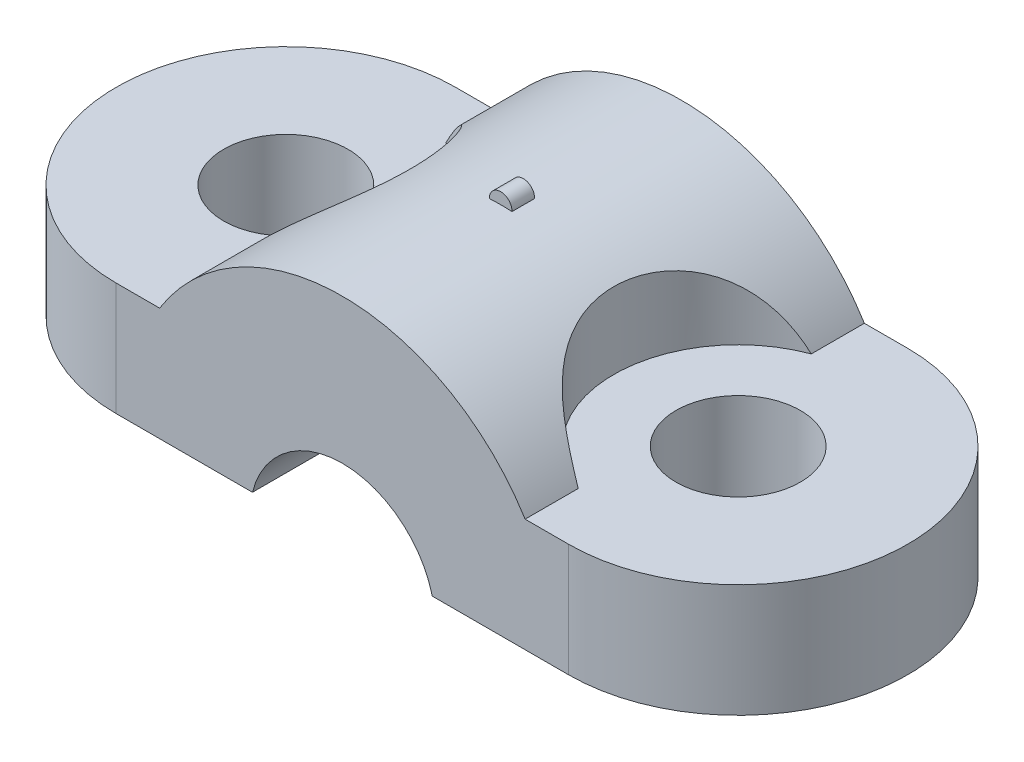
ISO-10303-21;
HEADER;
FILE_DESCRIPTION(('STEP AP214'),'2;1');
FILE_NAME('part.step','',(''),(''),'','','');
FILE_SCHEMA(('AUTOMOTIVE_DESIGN { 1 0 10303 214 1 1 1 1 }'));
ENDSEC;
DATA;
#1=APPLICATION_CONTEXT('core data for automotive mechanical design processes');
#2=APPLICATION_PROTOCOL_DEFINITION('international standard','automotive_design',2000,#1);
#3=PRODUCT_CONTEXT('',#1,'mechanical');
#4=PRODUCT('Part','Part','',(#3));
#5=PRODUCT_RELATED_PRODUCT_CATEGORY('part','',(#4));
#6=PRODUCT_DEFINITION_FORMATION('','',#4);
#7=PRODUCT_DEFINITION_CONTEXT('part definition',#1,'design');
#8=PRODUCT_DEFINITION('design','',#6,#7);
#9=PRODUCT_DEFINITION_SHAPE('','',#8);
#10=(LENGTH_UNIT() NAMED_UNIT(*) SI_UNIT(.MILLI.,.METRE.));
#11=(NAMED_UNIT(*) PLANE_ANGLE_UNIT() SI_UNIT($,.RADIAN.));
#12=(NAMED_UNIT(*) SI_UNIT($,.STERADIAN.) SOLID_ANGLE_UNIT());
#13=UNCERTAINTY_MEASURE_WITH_UNIT(LENGTH_MEASURE(1.E-05),#10,'distance_accuracy_value','');
#14=(GEOMETRIC_REPRESENTATION_CONTEXT(3) GLOBAL_UNCERTAINTY_ASSIGNED_CONTEXT((#13)) GLOBAL_UNIT_ASSIGNED_CONTEXT((#10,
#11,#12)) REPRESENTATION_CONTEXT('',''));
#15=CARTESIAN_POINT('',(0.,0.,0.));
#16=DIRECTION('',(0.,0.,1.));
#17=DIRECTION('',(1.,0.,0.));
#18=AXIS2_PLACEMENT_3D('',#15,#16,#17);
#19=CARTESIAN_POINT('',(0.,0.,0.));
#20=DIRECTION('',(0.,1.,0.));
#21=DIRECTION('',(0.,0.,1.));
#22=AXIS2_PLACEMENT_3D('',#19,#20,#21);
#23=PLANE('',#22);
#24=CARTESIAN_POINT('',(-10.,0.,0.));
#25=DIRECTION('',(0.,1.,0.));
#26=DIRECTION('',(0.,0.,1.));
#27=AXIS2_PLACEMENT_3D('',#24,#25,#26);
#28=CIRCLE('',#27,2.75);
#29=CARTESIAN_POINT('',(-10.,0.,2.75));
#30=VERTEX_POINT('',#29);
#31=EDGE_CURVE('E215',#30,#30,#28,.T.);
#32=ORIENTED_EDGE('',*,*,#31,.T.);
#33=EDGE_LOOP('',(#32));
#34=FACE_BOUND('',#33,.T.);
#35=DIRECTION('',(1.,0.,0.));
#36=VECTOR('',#35,1.);
#37=CARTESIAN_POINT('',(0.,0.,-7.5));
#38=LINE('',#37,#36);
#39=CARTESIAN_POINT('',(-10.,0.,-7.5));
#40=VERTEX_POINT('',#39);
#41=CARTESIAN_POINT('',(-3.97617907041421,0.,-7.5));
#42=VERTEX_POINT('',#41);
#43=EDGE_CURVE('E198',#40,#42,#38,.T.);
#44=ORIENTED_EDGE('',*,*,#43,.T.);
#45=DIRECTION('',(0.,0.,1.));
#46=VECTOR('',#45,1.);
#47=CARTESIAN_POINT('',(-3.97617907041421,0.,-7.5));
#48=LINE('',#47,#46);
#49=CARTESIAN_POINT('',(-3.97617907041421,0.,7.5));
#50=VERTEX_POINT('',#49);
#51=EDGE_CURVE('E147',#42,#50,#48,.T.);
#52=ORIENTED_EDGE('',*,*,#51,.T.);
#53=DIRECTION('',(1.,0.,0.));
#54=VECTOR('',#53,1.);
#55=CARTESIAN_POINT('',(0.,0.,7.5));
#56=LINE('',#55,#54);
#57=CARTESIAN_POINT('',(-10.,0.,7.5));
#58=VERTEX_POINT('',#57);
#59=EDGE_CURVE('E11',#58,#50,#56,.T.);
#60=ORIENTED_EDGE('',*,*,#59,.F.);
#61=CARTESIAN_POINT('',(-10.,0.,0.));
#62=DIRECTION('',(0.,1.,0.));
#63=DIRECTION('',(0.,0.,1.));
#64=AXIS2_PLACEMENT_3D('',#61,#62,#63);
#65=CIRCLE('',#64,7.5);
#66=EDGE_CURVE('E207',#40,#58,#65,.T.);
#67=ORIENTED_EDGE('',*,*,#66,.F.);
#68=EDGE_LOOP('',(#44,#52,#60,#67));
#69=FACE_BOUND('',#68,.T.);
#70=ADVANCED_FACE('F34',(#34,#69),#23,.F.);
#71=CARTESIAN_POINT('',(0.,9.5,-7.5));
#72=DIRECTION('',(0.,0.,-1.));
#73=DIRECTION('',(-1.,0.,0.));
#74=AXIS2_PLACEMENT_3D('',#71,#72,#73);
#75=PLANE('',#74);
#76=CARTESIAN_POINT('',(0.,-0.999999999999999,-7.5));
#77=DIRECTION('',(0.,0.,1.));
#78=DIRECTION('',(1.,0.,0.));
#79=AXIS2_PLACEMENT_3D('',#76,#77,#78);
#80=CIRCLE('',#79,4.1);
#81=CARTESIAN_POINT('',(3.97617907041421,0.,-7.5));
#82=VERTEX_POINT('',#81);
#83=EDGE_CURVE('E142',#82,#42,#80,.T.);
#84=ORIENTED_EDGE('',*,*,#83,.T.);
#85=ORIENTED_EDGE('',*,*,#43,.F.);
#86=DIRECTION('',(0.,-1.,0.));
#87=VECTOR('',#86,1.);
#88=CARTESIAN_POINT('',(-10.,5.,-7.5));
#89=LINE('',#88,#87);
#90=CARTESIAN_POINT('',(-10.,5.,-7.5));
#91=VERTEX_POINT('',#90);
#92=EDGE_CURVE('E208',#91,#40,#89,.T.);
#93=ORIENTED_EDGE('',*,*,#92,.F.);
#94=DIRECTION('',(1.,0.,0.));
#95=VECTOR('',#94,1.);
#96=CARTESIAN_POINT('',(0.,5.,-7.5));
#97=LINE('',#96,#95);
#98=CARTESIAN_POINT('',(-8.08,5.,-7.5));
#99=VERTEX_POINT('',#98);
#100=EDGE_CURVE('E228',#91,#99,#97,.T.);
#101=ORIENTED_EDGE('',*,*,#100,.T.);
#102=CARTESIAN_POINT('',(0.,-0.00404444444444992,-7.5));
#103=DIRECTION('',(0.,0.,1.));
#104=DIRECTION('',(1.,0.,0.));
#105=AXIS2_PLACEMENT_3D('',#102,#103,#104);
#106=CIRCLE('',#105,9.50404444444445);
#107=CARTESIAN_POINT('',(8.08,5.,-7.5));
#108=VERTEX_POINT('',#107);
#109=EDGE_CURVE('E158',#99,#108,#106,.F.);
#110=ORIENTED_EDGE('',*,*,#109,.T.);
#111=DIRECTION('',(1.,0.,0.));
#112=VECTOR('',#111,1.);
#113=CARTESIAN_POINT('',(0.,5.,-7.5));
#114=LINE('',#113,#112);
#115=CARTESIAN_POINT('',(10.,5.,-7.5));
#116=VERTEX_POINT('',#115);
#117=EDGE_CURVE('E249',#108,#116,#114,.T.);
#118=ORIENTED_EDGE('',*,*,#117,.T.);
#119=DIRECTION('',(0.,-1.,0.));
#120=VECTOR('',#119,1.);
#121=CARTESIAN_POINT('',(10.,5.,-7.5));
#122=LINE('',#121,#120);
#123=CARTESIAN_POINT('',(10.,0.,-7.5));
#124=VERTEX_POINT('',#123);
#125=EDGE_CURVE('E239',#116,#124,#122,.T.);
#126=ORIENTED_EDGE('',*,*,#125,.T.);
#127=EDGE_CURVE('E201',#82,#124,#38,.T.);
#128=ORIENTED_EDGE('',*,*,#127,.F.);
#129=EDGE_LOOP('',(#84,#85,#93,#101,#110,#118,#126,#128));
#130=FACE_BOUND('',#129,.T.);
#131=ADVANCED_FACE('F187',(#130),#75,.T.);
#132=CARTESIAN_POINT('',(0.,9.5,7.5));
#133=DIRECTION('',(0.,0.,-1.));
#134=DIRECTION('',(-1.,0.,0.));
#135=AXIS2_PLACEMENT_3D('',#132,#133,#134);
#136=PLANE('',#135);
#137=ORIENTED_EDGE('',*,*,#59,.T.);
#138=CARTESIAN_POINT('',(0.,-0.999999999999999,7.5));
#139=DIRECTION('',(0.,0.,1.));
#140=DIRECTION('',(1.,0.,0.));
#141=AXIS2_PLACEMENT_3D('',#138,#139,#140);
#142=CIRCLE('',#141,4.1);
#143=CARTESIAN_POINT('',(3.97617907041421,0.,7.5));
#144=VERTEX_POINT('',#143);
#145=EDGE_CURVE('E141',#144,#50,#142,.T.);
#146=ORIENTED_EDGE('',*,*,#145,.F.);
#147=CARTESIAN_POINT('',(10.,0.,7.5));
#148=VERTEX_POINT('',#147);
#149=EDGE_CURVE('E43',#144,#148,#56,.T.);
#150=ORIENTED_EDGE('',*,*,#149,.T.);
#151=DIRECTION('',(0.,-1.,0.));
#152=VECTOR('',#151,1.);
#153=CARTESIAN_POINT('',(10.,5.,7.5));
#154=LINE('',#153,#152);
#155=CARTESIAN_POINT('',(10.,5.,7.5));
#156=VERTEX_POINT('',#155);
#157=EDGE_CURVE('E220',#156,#148,#154,.T.);
#158=ORIENTED_EDGE('',*,*,#157,.F.);
#159=DIRECTION('',(1.,0.,0.));
#160=VECTOR('',#159,1.);
#161=CARTESIAN_POINT('',(0.,5.,7.5));
#162=LINE('',#161,#160);
#163=CARTESIAN_POINT('',(8.08,5.,7.5));
#164=VERTEX_POINT('',#163);
#165=EDGE_CURVE('E254',#164,#156,#162,.T.);
#166=ORIENTED_EDGE('',*,*,#165,.F.);
#167=CARTESIAN_POINT('',(0.,-0.00404444444444992,7.5));
#168=DIRECTION('',(0.,0.,1.));
#169=DIRECTION('',(1.,0.,0.));
#170=AXIS2_PLACEMENT_3D('',#167,#168,#169);
#171=CIRCLE('',#170,9.50404444444445);
#172=CARTESIAN_POINT('',(-8.08,5.,7.5));
#173=VERTEX_POINT('',#172);
#174=EDGE_CURVE('E157',#173,#164,#171,.F.);
#175=ORIENTED_EDGE('',*,*,#174,.F.);
#176=DIRECTION('',(1.,0.,0.));
#177=VECTOR('',#176,1.);
#178=CARTESIAN_POINT('',(0.,5.,7.5));
#179=LINE('',#178,#177);
#180=CARTESIAN_POINT('',(-10.,5.,7.5));
#181=VERTEX_POINT('',#180);
#182=EDGE_CURVE('E223',#181,#173,#179,.T.);
#183=ORIENTED_EDGE('',*,*,#182,.F.);
#184=DIRECTION('',(0.,-1.,0.));
#185=VECTOR('',#184,1.);
#186=CARTESIAN_POINT('',(-10.,5.,7.5));
#187=LINE('',#186,#185);
#188=EDGE_CURVE('E211',#181,#58,#187,.T.);
#189=ORIENTED_EDGE('',*,*,#188,.T.);
#190=EDGE_LOOP('',(#137,#146,#150,#158,#166,#175,#183,#189));
#191=FACE_BOUND('',#190,.T.);
#192=ADVANCED_FACE('F185',(#191),#136,.F.);
#193=CARTESIAN_POINT('',(10.,9.5,0.));
#194=DIRECTION('',(0.,-1.,0.));
#195=DIRECTION('',(0.,0.,-1.));
#196=AXIS2_PLACEMENT_3D('',#193,#194,#195);
#197=CYLINDRICAL_SURFACE('',#196,5.5);
#198=CARTESIAN_POINT('',(8.08,5.,5.1539887465923));
#199=CARTESIAN_POINT('',(7.99001563173181,5.14537029095498,5.12045202710558));
#200=CARTESIAN_POINT('',(7.89642080027451,5.2876648416954,5.08291490139109));
#201=CARTESIAN_POINT('',(7.70303619143883,5.56538729143438,4.99851462898592));
#202=CARTESIAN_POINT('',(7.60323825023025,5.70080569622129,4.95163900523841));
#203=CARTESIAN_POINT('',(7.39822899975281,5.96429797844464,4.84706858689315));
#204=CARTESIAN_POINT('',(7.29299392446025,6.09233332444659,4.78932275124168));
#205=CARTESIAN_POINT('',(7.07919423812253,6.33933866324696,4.66201228546329));
#206=CARTESIAN_POINT('',(6.97063158823109,6.4583138569845,4.59245451114239));
#207=CARTESIAN_POINT('',(6.77002561898331,6.66761599596033,4.45304749354069));
#208=CARTESIAN_POINT('',(6.67820013118659,6.75943742939677,4.38512546358434));
#209=CARTESIAN_POINT('',(6.49483287498101,6.93570850535153,4.23998448771444));
#210=CARTESIAN_POINT('',(6.4032910581131,7.02015948250038,4.16276723101617));
#211=CARTESIAN_POINT('',(6.22213791783691,7.18111426267204,3.99907706653871));
#212=CARTESIAN_POINT('',(6.13252200680799,7.25763913011599,3.91262999964637));
#213=CARTESIAN_POINT('',(5.95643697117863,7.40275908901513,3.7303687540728));
#214=CARTESIAN_POINT('',(5.86996780136252,7.47135429444287,3.63455471005909));
#215=CARTESIAN_POINT('',(5.70124719644635,7.60082296141688,3.43337170240056));
#216=CARTESIAN_POINT('',(5.61901839949237,7.66165711328524,3.32795839865091));
#217=CARTESIAN_POINT('',(5.46068184982798,7.77524301032143,3.10851985876541));
#218=CARTESIAN_POINT('',(5.38457425746823,7.8279945437903,2.99449439717768));
#219=CARTESIAN_POINT('',(5.23974783889334,7.92561771971182,2.75847560664738));
#220=CARTESIAN_POINT('',(5.17103605829657,7.97048187357141,2.63647485476747));
#221=CARTESIAN_POINT('',(5.04226321935938,8.05252280833811,2.3855256402096));
#222=CARTESIAN_POINT('',(4.98220169755516,8.08970000114394,2.25657755026534));
#223=CARTESIAN_POINT('',(4.87569571840315,8.15426707913313,2.00227913158619));
#224=CARTESIAN_POINT('',(4.82858229536027,8.18216883107698,1.87733791764317));
#225=CARTESIAN_POINT('',(4.7432772156176,8.23189039517921,1.62321717296968));
#226=CARTESIAN_POINT('',(4.70508867416853,8.25370808419313,1.49403618022434));
#227=CARTESIAN_POINT('',(4.63817572488957,8.29147622530342,1.23249757882539));
#228=CARTESIAN_POINT('',(4.60944532943068,8.30743039014418,1.10014203703577));
#229=CARTESIAN_POINT('',(4.56176669780388,8.33369431090743,0.833080930764921));
#230=CARTESIAN_POINT('',(4.5428218951031,8.34400208575988,0.698374558563418));
#231=CARTESIAN_POINT('',(4.51503828462937,8.35906135478321,0.428380394727918));
#232=CARTESIAN_POINT('',(4.50614357629464,8.36384358648628,0.293100062555013));
#233=CARTESIAN_POINT('',(4.49837528890235,8.36802222045578,0.0221690513639427));
#234=CARTESIAN_POINT('',(4.49950170082585,8.36741862756942,-0.113481627320805));
#235=CARTESIAN_POINT('',(4.51176368608058,8.36081643472608,-0.38422471554139));
#236=CARTESIAN_POINT('',(4.52290120430723,8.35481678645693,-0.519317011474745));
#237=CARTESIAN_POINT('',(4.55505038849556,8.33734097223021,-0.787916170946606));
#238=CARTESIAN_POINT('',(4.57605862016963,8.32586671101677,-0.921423569362649));
#239=CARTESIAN_POINT('',(4.62781292988375,8.29722570836424,-1.1865638287248));
#240=CARTESIAN_POINT('',(4.6586034271825,8.28003298351272,-1.31818521911614));
#241=CARTESIAN_POINT('',(4.72949049511725,8.23976776054407,-1.57792413672532));
#242=CARTESIAN_POINT('',(4.7695835890645,8.21669745875729,-1.70604295302427));
#243=CARTESIAN_POINT('',(4.85856357954256,8.16442428944372,-1.95792604850737));
#244=CARTESIAN_POINT('',(4.90745190221837,8.13522042723227,-2.0816896175919));
#245=CARTESIAN_POINT('',(5.01334827876581,8.07042458381926,-2.32395800884918));
#246=CARTESIAN_POINT('',(5.07035625249683,8.03483266566663,-2.44246288290989));
#247=CARTESIAN_POINT('',(5.19132819405616,7.95724331145843,-2.67273122361642));
#248=CARTESIAN_POINT('',(5.25525007007142,7.91528407191326,-2.7845296835744));
#249=CARTESIAN_POINT('',(5.38938362745487,7.82461791597135,-3.00141201562999));
#250=CARTESIAN_POINT('',(5.45959524542943,7.77591106758035,-3.10649595538424));
#251=CARTESIAN_POINT('',(5.6051944297775,7.67167449225916,-3.30926716864003));
#252=CARTESIAN_POINT('',(5.68057711881361,7.61615115661414,-3.40696123419716));
#253=CARTESIAN_POINT('',(5.83547574864086,7.49819261477784,-3.59465579730305));
#254=CARTESIAN_POINT('',(5.91499314997896,7.43575495724966,-3.68465354610437));
#255=CARTESIAN_POINT('',(6.07793913790115,7.30325823694817,-3.85768486544204));
#256=CARTESIAN_POINT('',(6.16140331673655,7.23311637598895,-3.94062141037416));
#257=CARTESIAN_POINT('',(6.33012485404885,7.086012440228,-4.09821250960134));
#258=CARTESIAN_POINT('',(6.41538237096791,7.00904976085756,-4.17286632842706));
#259=CARTESIAN_POINT('',(6.58670164493307,6.84840333431155,-4.31413384543037));
#260=CARTESIAN_POINT('',(6.67276477776184,6.76470488678345,-4.38072911800364));
#261=CARTESIAN_POINT('',(6.84439122105345,6.59111047836797,-4.50593131531683));
#262=CARTESIAN_POINT('',(6.92995461226864,6.50121555060063,-4.56453956688047));
#263=CARTESIAN_POINT('',(7.11039937051045,6.30381993408541,-4.68115048657111));
#264=CARTESIAN_POINT('',(7.20508286045697,6.1955337381665,-4.73812944608902));
#265=CARTESIAN_POINT('',(7.39139372656363,5.97218594834049,-4.84320317212035));
#266=CARTESIAN_POINT('',(7.48302002866022,5.85712201170591,-4.8912948426942));
#267=CARTESIAN_POINT('',(7.66177586574647,5.62141615772103,-4.97921645036869));
#268=CARTESIAN_POINT('',(7.74892334902326,5.50080089762206,-5.01908167299271));
#269=CARTESIAN_POINT('',(7.91830939750818,5.2542538569602,-5.0916615235222));
#270=CARTESIAN_POINT('',(8.00055221110987,5.12832684372751,-5.12438240717257));
#271=CARTESIAN_POINT('',(8.08,5.,-5.15398874659229));
#272=B_SPLINE_CURVE_WITH_KNOTS('',3,(#198,#199,#200,#201,#202,#203,#204,#205,#206,#207,#208,
#209,#210,#211,#212,#213,#214,#215,#216,#217,#218,#219,#220,#221,#222,#223,#224,#225,#226,#227,
#228,#229,#230,#231,#232,#233,#234,#235,#236,#237,#238,#239,#240,#241,#242,#243,#244,#245,#246,
#247,#248,#249,#250,#251,#252,#253,#254,#255,#256,#257,#258,#259,#260,#261,#262,#263,#264,#265,
#266,#267,#268,#269,#270,#271),.UNSPECIFIED.,.F.,.F.,(4,2,2,2,2,2,2,2,2,2,2,2,2,2,2,2,2,2,2,2,2,
2,2,2,2,2,2,2,2,2,2,2,2,2,2,2,4),(0.,0.522671156148208,1.04604538796136,1.57194135890126,
2.09753312963723,2.5367327541687,2.97585268340231,3.41377393017173,3.85168888194289,
4.29174054629022,4.73180373444884,5.17228250589281,5.61273766856725,6.02148927877775,
6.430383352304,6.83901806893623,7.24779606584504,7.65428899213027,8.06078155257461,
8.46735310093515,8.87378329671269,9.28208603941171,9.69023643093759,10.0984530637356,
10.5066656677327,10.9125197880747,11.3183698183164,11.7238421801669,12.1294587572976,
12.5399647620607,12.9505071888116,13.3619712478386,13.7733668698959,14.237049740574,
14.7008938346784,15.1627050054456,15.624110167645),.UNSPECIFIED.);
#273=CARTESIAN_POINT('',(8.08,5.,5.15398874659229));
#274=VERTEX_POINT('',#273);
#275=CARTESIAN_POINT('',(8.08,5.,-5.15398874659229));
#276=VERTEX_POINT('',#275);
#277=EDGE_CURVE('E150',#274,#276,#272,.T.);
#278=ORIENTED_EDGE('',*,*,#277,.F.);
#279=CARTESIAN_POINT('',(10.,5.,0.));
#280=DIRECTION('',(0.,1.,0.));
#281=DIRECTION('',(0.,0.,1.));
#282=AXIS2_PLACEMENT_3D('',#279,#280,#281);
#283=CIRCLE('',#282,5.5);
#284=EDGE_CURVE('E257',#276,#274,#283,.T.);
#285=ORIENTED_EDGE('',*,*,#284,.F.);
#286=EDGE_LOOP('',(#278,#285));
#287=FACE_BOUND('',#286,.T.);
#288=ADVANCED_FACE('F36',(#287),#197,.F.);
#289=CARTESIAN_POINT('',(-10.,9.5,0.));
#290=DIRECTION('',(0.,-1.,0.));
#291=DIRECTION('',(0.,0.,-1.));
#292=AXIS2_PLACEMENT_3D('',#289,#290,#291);
#293=CYLINDRICAL_SURFACE('',#292,5.5);
#294=CARTESIAN_POINT('',(-8.08,5.,-5.15398874659229));
#295=CARTESIAN_POINT('',(-7.99001563173182,5.14537029095499,-5.12045202710558));
#296=CARTESIAN_POINT('',(-7.89642080027452,5.28766484169541,-5.08291490139109));
#297=CARTESIAN_POINT('',(-7.70303619143883,5.56538729143438,-4.99851462898592));
#298=CARTESIAN_POINT('',(-7.60323825023026,5.7008056962213,-4.95163900523841));
#299=CARTESIAN_POINT('',(-7.39822899975281,5.96429797844465,-4.84706858689314));
#300=CARTESIAN_POINT('',(-7.29299392446025,6.09233332444659,-4.78932275124168));
#301=CARTESIAN_POINT('',(-7.07919423812253,6.33933866324696,-4.66201228546328));
#302=CARTESIAN_POINT('',(-6.9706315882311,6.45831385698451,-4.59245451114239));
#303=CARTESIAN_POINT('',(-6.77002561898331,6.66761599596033,-4.45304749354069));
#304=CARTESIAN_POINT('',(-6.67820013118659,6.75943742939678,-4.38512546358434));
#305=CARTESIAN_POINT('',(-6.49483287498101,6.93570850535153,-4.23998448771444));
#306=CARTESIAN_POINT('',(-6.4032910581131,7.02015948250038,-4.16276723101617));
#307=CARTESIAN_POINT('',(-6.22213791783691,7.18111426267204,-3.9990770665387));
#308=CARTESIAN_POINT('',(-6.13252200680799,7.25763913011599,-3.91262999964637));
#309=CARTESIAN_POINT('',(-5.95643697117864,7.40275908901513,-3.7303687540728));
#310=CARTESIAN_POINT('',(-5.86996780136253,7.47135429444287,-3.63455471005909));
#311=CARTESIAN_POINT('',(-5.70124719644635,7.60082296141688,-3.43337170240056));
#312=CARTESIAN_POINT('',(-5.61901839949237,7.66165711328524,-3.32795839865091));
#313=CARTESIAN_POINT('',(-5.46068184982799,7.77524301032144,-3.10851985876541));
#314=CARTESIAN_POINT('',(-5.38457425746824,7.8279945437903,-2.99449439717768));
#315=CARTESIAN_POINT('',(-5.23974783889334,7.92561771971182,-2.75847560664738));
#316=CARTESIAN_POINT('',(-5.17103605829658,7.97048187357141,-2.63647485476747));
#317=CARTESIAN_POINT('',(-5.04226321935938,8.05252280833811,-2.3855256402096));
#318=CARTESIAN_POINT('',(-4.98220169755516,8.08970000114394,-2.25657755026534));
#319=CARTESIAN_POINT('',(-4.87569571840315,8.15426707913313,-2.0022791315862));
#320=CARTESIAN_POINT('',(-4.82858229536027,8.18216883107698,-1.87733791764317));
#321=CARTESIAN_POINT('',(-4.74327721561761,8.23189039517922,-1.62321717296969));
#322=CARTESIAN_POINT('',(-4.70508867416853,8.25370808419313,-1.49403618022434));
#323=CARTESIAN_POINT('',(-4.63817572488957,8.29147622530342,-1.2324975788254));
#324=CARTESIAN_POINT('',(-4.60944532943068,8.30743039014418,-1.10014203703578));
#325=CARTESIAN_POINT('',(-4.56176669780389,8.33369431090743,-0.833080930764929));
#326=CARTESIAN_POINT('',(-4.5428218951031,8.34400208575988,-0.698374558563427));
#327=CARTESIAN_POINT('',(-4.51503828462937,8.35906135478321,-0.428380394727927));
#328=CARTESIAN_POINT('',(-4.50614357629464,8.36384358648628,-0.293100062555022));
#329=CARTESIAN_POINT('',(-4.49837528890235,8.36802222045578,-0.0221690513639521));
#330=CARTESIAN_POINT('',(-4.49950170082585,8.36741862756942,0.113481627320795));
#331=CARTESIAN_POINT('',(-4.51176368608058,8.36081643472609,0.384224715541381));
#332=CARTESIAN_POINT('',(-4.52290120430723,8.35481678645693,0.519317011474737));
#333=CARTESIAN_POINT('',(-4.55505038849556,8.33734097223022,0.787916170946599));
#334=CARTESIAN_POINT('',(-4.57605862016964,8.32586671101678,0.921423569362642));
#335=CARTESIAN_POINT('',(-4.62781292988375,8.29722570836424,1.18656382872479));
#336=CARTESIAN_POINT('',(-4.6586034271825,8.28003298351273,1.31818521911613));
#337=CARTESIAN_POINT('',(-4.72949049511725,8.23976776054407,1.57792413672531));
#338=CARTESIAN_POINT('',(-4.7695835890645,8.21669745875729,1.70604295302426));
#339=CARTESIAN_POINT('',(-4.85856357954256,8.16442428944372,1.95792604850737));
#340=CARTESIAN_POINT('',(-4.90745190221837,8.13522042723227,2.08168961759189));
#341=CARTESIAN_POINT('',(-5.01334827876581,8.07042458381927,2.32395800884917));
#342=CARTESIAN_POINT('',(-5.07035625249683,8.03483266566664,2.44246288290988));
#343=CARTESIAN_POINT('',(-5.19132819405616,7.95724331145843,2.67273122361641));
#344=CARTESIAN_POINT('',(-5.25525007007141,7.91528407191326,2.7845296835744));
#345=CARTESIAN_POINT('',(-5.38938362745487,7.82461791597136,3.00141201562998));
#346=CARTESIAN_POINT('',(-5.45959524542943,7.77591106758036,3.10649595538423));
#347=CARTESIAN_POINT('',(-5.6051944297775,7.67167449225917,3.30926716864003));
#348=CARTESIAN_POINT('',(-5.68057711881361,7.61615115661414,3.40696123419715));
#349=CARTESIAN_POINT('',(-5.83547574864086,7.49819261477785,3.59465579730305));
#350=CARTESIAN_POINT('',(-5.91499314997896,7.43575495724967,3.68465354610436));
#351=CARTESIAN_POINT('',(-6.07793913790115,7.30325823694818,3.85768486544203));
#352=CARTESIAN_POINT('',(-6.16140331673655,7.23311637598896,3.94062141037416));
#353=CARTESIAN_POINT('',(-6.33012485404885,7.086012440228,4.09821250960133));
#354=CARTESIAN_POINT('',(-6.4153823709679,7.00904976085757,4.17286632842706));
#355=CARTESIAN_POINT('',(-6.58670164493307,6.84840333431156,4.31413384543037));
#356=CARTESIAN_POINT('',(-6.67276477776184,6.76470488678345,4.38072911800364));
#357=CARTESIAN_POINT('',(-6.84439122105345,6.59111047836798,4.50593131531683));
#358=CARTESIAN_POINT('',(-6.92995461226863,6.50121555060064,4.56453956688047));
#359=CARTESIAN_POINT('',(-7.11039937051045,6.30381993408542,4.68115048657111));
#360=CARTESIAN_POINT('',(-7.20508286045697,6.19553373816651,4.73812944608902));
#361=CARTESIAN_POINT('',(-7.39139372656363,5.9721859483405,4.84320317212035));
#362=CARTESIAN_POINT('',(-7.48302002866022,5.85712201170592,4.8912948426942));
#363=CARTESIAN_POINT('',(-7.66177586574647,5.62141615772104,4.97921645036869));
#364=CARTESIAN_POINT('',(-7.74892334902326,5.50080089762206,5.01908167299271));
#365=CARTESIAN_POINT('',(-7.91830939750818,5.25425385696021,5.0916615235222));
#366=CARTESIAN_POINT('',(-8.00055221110987,5.12832684372751,5.12438240717257));
#367=CARTESIAN_POINT('',(-8.08,5.,5.15398874659229));
#368=B_SPLINE_CURVE_WITH_KNOTS('',3,(#294,#295,#296,#297,#298,#299,#300,#301,#302,#303,#304,
#305,#306,#307,#308,#309,#310,#311,#312,#313,#314,#315,#316,#317,#318,#319,#320,#321,#322,#323,
#324,#325,#326,#327,#328,#329,#330,#331,#332,#333,#334,#335,#336,#337,#338,#339,#340,#341,#342,
#343,#344,#345,#346,#347,#348,#349,#350,#351,#352,#353,#354,#355,#356,#357,#358,#359,#360,#361,
#362,#363,#364,#365,#366,#367),.UNSPECIFIED.,.F.,.F.,(4,2,2,2,2,2,2,2,2,2,2,2,2,2,2,2,2,2,2,2,2,
2,2,2,2,2,2,2,2,2,2,2,2,2,2,2,4),(0.,0.522671156148207,1.04604538796136,1.57194135890126,
2.09753312963723,2.53673275416869,2.9758526834023,3.41377393017173,3.85168888194288,
4.29174054629021,4.73180373444883,5.1722825058928,5.61273766856724,6.02148927877773,
6.43038335230398,6.83901806893622,7.24779606584503,7.65428899213026,8.0607815525746,
8.46735310093514,8.87378329671268,9.2820860394117,9.69023643093758,10.0984530637356,
10.5066656677327,10.9125197880747,11.3183698183164,11.7238421801669,12.1294587572976,
12.5399647620607,12.9505071888116,13.3619712478386,13.7733668698959,14.237049740574,
14.7008938346784,15.1627050054456,15.624110167645),.UNSPECIFIED.);
#369=CARTESIAN_POINT('',(-8.08,5.,-5.15398874659229));
#370=VERTEX_POINT('',#369);
#371=CARTESIAN_POINT('',(-8.08,5.,5.15398874659229));
#372=VERTEX_POINT('',#371);
#373=EDGE_CURVE('E170',#370,#372,#368,.T.);
#374=ORIENTED_EDGE('',*,*,#373,.F.);
#375=CARTESIAN_POINT('',(-10.,5.,0.));
#376=DIRECTION('',(0.,1.,0.));
#377=DIRECTION('',(0.,0.,1.));
#378=AXIS2_PLACEMENT_3D('',#375,#376,#377);
#379=CIRCLE('',#378,5.5);
#380=EDGE_CURVE('E233',#372,#370,#379,.T.);
#381=ORIENTED_EDGE('',*,*,#380,.F.);
#382=EDGE_LOOP('',(#374,#381));
#383=FACE_BOUND('',#382,.T.);
#384=ADVANCED_FACE('F179',(#383),#293,.F.);
#385=ORIENTED_EDGE('',*,*,#149,.F.);
#386=DIRECTION('',(0.,0.,1.));
#387=VECTOR('',#386,1.);
#388=CARTESIAN_POINT('',(3.97617907041421,0.,-7.5));
#389=LINE('',#388,#387);
#390=EDGE_CURVE('E145',#82,#144,#389,.T.);
#391=ORIENTED_EDGE('',*,*,#390,.F.);
#392=ORIENTED_EDGE('',*,*,#127,.T.);
#393=CARTESIAN_POINT('',(10.,0.,0.));
#394=DIRECTION('',(0.,1.,0.));
#395=DIRECTION('',(0.,0.,1.));
#396=AXIS2_PLACEMENT_3D('',#393,#394,#395);
#397=CIRCLE('',#396,7.5);
#398=EDGE_CURVE('E176',#148,#124,#397,.T.);
#399=ORIENTED_EDGE('',*,*,#398,.F.);
#400=EDGE_LOOP('',(#385,#391,#392,#399));
#401=FACE_BOUND('',#400,.T.);
#402=CARTESIAN_POINT('',(10.,0.,0.));
#403=DIRECTION('',(0.,1.,0.));
#404=DIRECTION('',(0.,0.,1.));
#405=AXIS2_PLACEMENT_3D('',#402,#403,#404);
#406=CIRCLE('',#405,2.75);
#407=CARTESIAN_POINT('',(10.,0.,2.75));
#408=VERTEX_POINT('',#407);
#409=EDGE_CURVE('E242',#408,#408,#406,.T.);
#410=ORIENTED_EDGE('',*,*,#409,.T.);
#411=EDGE_LOOP('',(#410));
#412=FACE_BOUND('',#411,.T.);
#413=ADVANCED_FACE('F183',(#401,#412),#23,.F.);
#414=CARTESIAN_POINT('',(-10.,5.,0.));
#415=DIRECTION('',(0.,-1.,0.));
#416=DIRECTION('',(0.,0.,-1.));
#417=AXIS2_PLACEMENT_3D('',#414,#415,#416);
#418=CYLINDRICAL_SURFACE('',#417,7.5);
#419=ORIENTED_EDGE('',*,*,#66,.T.);
#420=ORIENTED_EDGE('',*,*,#188,.F.);
#421=CARTESIAN_POINT('',(-10.,5.,0.));
#422=DIRECTION('',(0.,1.,0.));
#423=DIRECTION('',(0.,0.,1.));
#424=AXIS2_PLACEMENT_3D('',#421,#422,#423);
#425=CIRCLE('',#424,7.5);
#426=EDGE_CURVE('E226',#91,#181,#425,.T.);
#427=ORIENTED_EDGE('',*,*,#426,.F.);
#428=ORIENTED_EDGE('',*,*,#92,.T.);
#429=EDGE_LOOP('',(#419,#420,#427,#428));
#430=FACE_BOUND('',#429,.T.);
#431=ADVANCED_FACE('F283',(#430),#418,.T.);
#432=CARTESIAN_POINT('',(-10.,5.,0.));
#433=DIRECTION('',(0.,-1.,0.));
#434=DIRECTION('',(0.,0.,-1.));
#435=AXIS2_PLACEMENT_3D('',#432,#433,#434);
#436=CYLINDRICAL_SURFACE('',#435,2.75);
#437=CARTESIAN_POINT('',(-10.,5.,0.));
#438=DIRECTION('',(0.,1.,0.));
#439=DIRECTION('',(0.,0.,1.));
#440=AXIS2_PLACEMENT_3D('',#437,#438,#439);
#441=CIRCLE('',#440,2.75);
#442=CARTESIAN_POINT('',(-10.,5.,2.75));
#443=VERTEX_POINT('',#442);
#444=EDGE_CURVE('E214',#443,#443,#441,.T.);
#445=ORIENTED_EDGE('',*,*,#444,.T.);
#446=EDGE_LOOP('',(#445));
#447=FACE_BOUND('',#446,.T.);
#448=ORIENTED_EDGE('',*,*,#31,.F.);
#449=EDGE_LOOP('',(#448));
#450=FACE_BOUND('',#449,.T.);
#451=ADVANCED_FACE('F291',(#447,#450),#436,.F.);
#452=CARTESIAN_POINT('',(0.,5.,0.));
#453=DIRECTION('',(0.,1.,0.));
#454=DIRECTION('',(0.,0.,1.));
#455=AXIS2_PLACEMENT_3D('',#452,#453,#454);
#456=PLANE('',#455);
#457=ORIENTED_EDGE('',*,*,#444,.F.);
#458=EDGE_LOOP('',(#457));
#459=FACE_BOUND('',#458,.T.);
#460=DIRECTION('',(0.,0.,1.));
#461=VECTOR('',#460,1.);
#462=CARTESIAN_POINT('',(-8.08,5.,0.));
#463=LINE('',#462,#461);
#464=EDGE_CURVE('E218',#372,#173,#463,.T.);
#465=ORIENTED_EDGE('',*,*,#464,.F.);
#466=ORIENTED_EDGE('',*,*,#380,.T.);
#467=DIRECTION('',(0.,0.,1.));
#468=VECTOR('',#467,1.);
#469=CARTESIAN_POINT('',(-8.08,5.,0.));
#470=LINE('',#469,#468);
#471=EDGE_CURVE('E231',#99,#370,#470,.T.);
#472=ORIENTED_EDGE('',*,*,#471,.F.);
#473=ORIENTED_EDGE('',*,*,#100,.F.);
#474=ORIENTED_EDGE('',*,*,#426,.T.);
#475=ORIENTED_EDGE('',*,*,#182,.T.);
#476=EDGE_LOOP('',(#465,#466,#472,#473,#474,#475));
#477=FACE_BOUND('',#476,.T.);
#478=ADVANCED_FACE('F299',(#459,#477),#456,.T.);
#479=CARTESIAN_POINT('',(10.,5.,0.));
#480=DIRECTION('',(0.,-1.,0.));
#481=DIRECTION('',(0.,0.,-1.));
#482=AXIS2_PLACEMENT_3D('',#479,#480,#481);
#483=CYLINDRICAL_SURFACE('',#482,7.5);
#484=ORIENTED_EDGE('',*,*,#398,.T.);
#485=ORIENTED_EDGE('',*,*,#125,.F.);
#486=CARTESIAN_POINT('',(10.,5.,0.));
#487=DIRECTION('',(0.,1.,0.));
#488=DIRECTION('',(0.,0.,1.));
#489=AXIS2_PLACEMENT_3D('',#486,#487,#488);
#490=CIRCLE('',#489,7.5);
#491=EDGE_CURVE('E252',#156,#116,#490,.T.);
#492=ORIENTED_EDGE('',*,*,#491,.F.);
#493=ORIENTED_EDGE('',*,*,#157,.T.);
#494=EDGE_LOOP('',(#484,#485,#492,#493));
#495=FACE_BOUND('',#494,.T.);
#496=ADVANCED_FACE('F307',(#495),#483,.T.);
#497=CARTESIAN_POINT('',(10.,5.,0.));
#498=DIRECTION('',(0.,-1.,0.));
#499=DIRECTION('',(0.,0.,-1.));
#500=AXIS2_PLACEMENT_3D('',#497,#498,#499);
#501=CYLINDRICAL_SURFACE('',#500,2.75);
#502=CARTESIAN_POINT('',(10.,5.,0.));
#503=DIRECTION('',(0.,1.,0.));
#504=DIRECTION('',(0.,0.,1.));
#505=AXIS2_PLACEMENT_3D('',#502,#503,#504);
#506=CIRCLE('',#505,2.75);
#507=CARTESIAN_POINT('',(10.,5.,2.75));
#508=VERTEX_POINT('',#507);
#509=EDGE_CURVE('E241',#508,#508,#506,.T.);
#510=ORIENTED_EDGE('',*,*,#509,.T.);
#511=EDGE_LOOP('',(#510));
#512=FACE_BOUND('',#511,.T.);
#513=ORIENTED_EDGE('',*,*,#409,.F.);
#514=EDGE_LOOP('',(#513));
#515=FACE_BOUND('',#514,.T.);
#516=ADVANCED_FACE('F315',(#512,#515),#501,.F.);
#517=CARTESIAN_POINT('',(0.,5.,0.));
#518=DIRECTION('',(0.,1.,0.));
#519=DIRECTION('',(0.,0.,1.));
#520=AXIS2_PLACEMENT_3D('',#517,#518,#519);
#521=PLANE('',#520);
#522=ORIENTED_EDGE('',*,*,#509,.F.);
#523=EDGE_LOOP('',(#522));
#524=FACE_BOUND('',#523,.T.);
#525=DIRECTION('',(0.,0.,1.));
#526=VECTOR('',#525,1.);
#527=CARTESIAN_POINT('',(8.08,5.,0.));
#528=LINE('',#527,#526);
#529=EDGE_CURVE('E177',#108,#276,#528,.T.);
#530=ORIENTED_EDGE('',*,*,#529,.T.);
#531=ORIENTED_EDGE('',*,*,#284,.T.);
#532=DIRECTION('',(0.,0.,-1.));
#533=VECTOR('',#532,1.);
#534=CARTESIAN_POINT('',(8.08,5.,0.));
#535=LINE('',#534,#533);
#536=EDGE_CURVE('E256',#164,#274,#535,.T.);
#537=ORIENTED_EDGE('',*,*,#536,.F.);
#538=ORIENTED_EDGE('',*,*,#165,.T.);
#539=ORIENTED_EDGE('',*,*,#491,.T.);
#540=ORIENTED_EDGE('',*,*,#117,.F.);
#541=EDGE_LOOP('',(#530,#531,#537,#538,#539,#540));
#542=FACE_BOUND('',#541,.T.);
#543=ADVANCED_FACE('F165',(#524,#542),#521,.T.);
#544=CARTESIAN_POINT('',(0.,-0.00404444444444992,-7.5));
#545=DIRECTION('',(0.,0.,1.));
#546=DIRECTION('',(1.,0.,0.));
#547=AXIS2_PLACEMENT_3D('',#544,#545,#546);
#548=CYLINDRICAL_SURFACE('',#547,9.50404444444445);
#549=DIRECTION('',(0.,0.,-1.));
#550=VECTOR('',#549,1.);
#551=CARTESIAN_POINT('',(0.499826987192359,9.48684770460295,0.5));
#552=LINE('',#551,#550);
#553=CARTESIAN_POINT('',(0.499826987192355,9.48684770460295,0.5));
#554=VERTEX_POINT('',#553);
#555=CARTESIAN_POINT('',(0.499826987192359,9.48684770460295,-0.5));
#556=VERTEX_POINT('',#555);
#557=EDGE_CURVE('E55',#554,#556,#552,.T.);
#558=ORIENTED_EDGE('',*,*,#557,.F.);
#559=CARTESIAN_POINT('',(0.,-0.00404444444444992,0.5));
#560=DIRECTION('',(0.,0.,1.));
#561=DIRECTION('',(1.,0.,0.));
#562=AXIS2_PLACEMENT_3D('',#559,#560,#561);
#563=CIRCLE('',#562,9.50404444444445);
#564=CARTESIAN_POINT('',(-0.499826987192359,9.48684770460295,0.5));
#565=VERTEX_POINT('',#564);
#566=EDGE_CURVE('E50',#554,#565,#563,.T.);
#567=ORIENTED_EDGE('',*,*,#566,.T.);
#568=DIRECTION('',(0.,0.,-1.));
#569=VECTOR('',#568,1.);
#570=CARTESIAN_POINT('',(-0.499826987192363,9.48684770460295,0.5));
#571=LINE('',#570,#569);
#572=CARTESIAN_POINT('',(-0.499826987192363,9.48684770460295,-0.5));
#573=VERTEX_POINT('',#572);
#574=EDGE_CURVE('E121',#565,#573,#571,.T.);
#575=ORIENTED_EDGE('',*,*,#574,.T.);
#576=CARTESIAN_POINT('',(0.,-0.00404444444444992,-0.5));
#577=DIRECTION('',(0.,0.,1.));
#578=DIRECTION('',(1.,0.,0.));
#579=AXIS2_PLACEMENT_3D('',#576,#577,#578);
#580=CIRCLE('',#579,9.50404444444445);
#581=EDGE_CURVE('E126',#556,#573,#580,.T.);
#582=ORIENTED_EDGE('',*,*,#581,.F.);
#583=EDGE_LOOP('',(#558,#567,#575,#582));
#584=FACE_BOUND('',#583,.T.);
#585=ORIENTED_EDGE('',*,*,#373,.T.);
#586=ORIENTED_EDGE('',*,*,#464,.T.);
#587=ORIENTED_EDGE('',*,*,#174,.T.);
#588=ORIENTED_EDGE('',*,*,#536,.T.);
#589=ORIENTED_EDGE('',*,*,#277,.T.);
#590=ORIENTED_EDGE('',*,*,#529,.F.);
#591=ORIENTED_EDGE('',*,*,#109,.F.);
#592=ORIENTED_EDGE('',*,*,#471,.T.);
#593=EDGE_LOOP('',(#585,#586,#587,#588,#589,#590,#591,#592));
#594=FACE_BOUND('',#593,.T.);
#595=ADVANCED_FACE('F123',(#584,#594),#548,.T.);
#596=CARTESIAN_POINT('',(0.,-0.999999999999999,-7.5));
#597=DIRECTION('',(0.,0.,1.));
#598=DIRECTION('',(1.,0.,0.));
#599=AXIS2_PLACEMENT_3D('',#596,#597,#598);
#600=CYLINDRICAL_SURFACE('',#599,4.1);
#601=ORIENTED_EDGE('',*,*,#145,.T.);
#602=ORIENTED_EDGE('',*,*,#51,.F.);
#603=ORIENTED_EDGE('',*,*,#83,.F.);
#604=ORIENTED_EDGE('',*,*,#390,.T.);
#605=EDGE_LOOP('',(#601,#602,#603,#604));
#606=FACE_BOUND('',#605,.T.);
#607=ADVANCED_FACE('F164',(#606),#600,.F.);
#608=CARTESIAN_POINT('',(0.,9.5,0.5));
#609=DIRECTION('',(0.,0.,-1.));
#610=DIRECTION('',(-1.,0.,0.));
#611=AXIS2_PLACEMENT_3D('',#608,#609,#610);
#612=CYLINDRICAL_SURFACE('',#611,0.5);
#613=CARTESIAN_POINT('',(0.,9.5,-0.5));
#614=DIRECTION('',(0.,0.,1.));
#615=DIRECTION('',(1.,0.,0.));
#616=AXIS2_PLACEMENT_3D('',#613,#614,#615);
#617=CIRCLE('',#616,0.5);
#618=EDGE_CURVE('E131',#556,#573,#617,.T.);
#619=ORIENTED_EDGE('',*,*,#618,.T.);
#620=ORIENTED_EDGE('',*,*,#574,.F.);
#621=CARTESIAN_POINT('',(0.,9.5,0.5));
#622=DIRECTION('',(0.,0.,1.));
#623=DIRECTION('',(1.,0.,0.));
#624=AXIS2_PLACEMENT_3D('',#621,#622,#623);
#625=CIRCLE('',#624,0.5);
#626=EDGE_CURVE('E128',#554,#565,#625,.T.);
#627=ORIENTED_EDGE('',*,*,#626,.F.);
#628=ORIENTED_EDGE('',*,*,#557,.T.);
#629=EDGE_LOOP('',(#619,#620,#627,#628));
#630=FACE_BOUND('',#629,.T.);
#631=ADVANCED_FACE('F132',(#630),#612,.T.);
#632=CARTESIAN_POINT('',(0.,0.,0.5));
#633=DIRECTION('',(0.,0.,1.));
#634=DIRECTION('',(1.,0.,0.));
#635=AXIS2_PLACEMENT_3D('',#632,#633,#634);
#636=PLANE('',#635);
#637=ORIENTED_EDGE('',*,*,#566,.F.);
#638=ORIENTED_EDGE('',*,*,#626,.T.);
#639=EDGE_LOOP('',(#637,#638));
#640=FACE_BOUND('',#639,.T.);
#641=ADVANCED_FACE('F344',(#640),#636,.T.);
#642=CARTESIAN_POINT('',(0.,0.,-0.5));
#643=DIRECTION('',(0.,0.,1.));
#644=DIRECTION('',(1.,0.,0.));
#645=AXIS2_PLACEMENT_3D('',#642,#643,#644);
#646=PLANE('',#645);
#647=ORIENTED_EDGE('',*,*,#581,.T.);
#648=ORIENTED_EDGE('',*,*,#618,.F.);
#649=EDGE_LOOP('',(#647,#648));
#650=FACE_BOUND('',#649,.T.);
#651=ADVANCED_FACE('F135',(#650),#646,.F.);
#652=CLOSED_SHELL('',(#70,#131,#192,#288,#384,#413,#431,#451,#478,#496,#516,#543,#595,#607,#631,
#641,#651));
#653=MANIFOLD_SOLID_BREP('B2',#652);
#654=ADVANCED_BREP_SHAPE_REPRESENTATION('',(#18,#653),#14);
#655=SHAPE_DEFINITION_REPRESENTATION(#9,#654);
ENDSEC;
END-ISO-10303-21;
